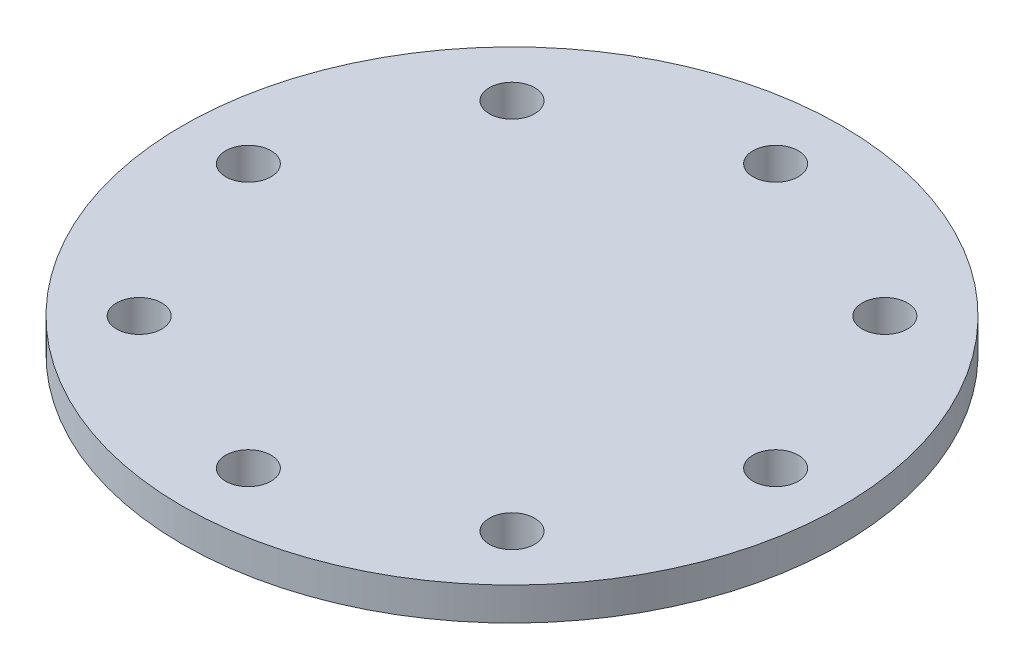
ISO-10303-21;
HEADER;
FILE_DESCRIPTION(('STEP AP214'),'2;1');
FILE_NAME('part.step','',(''),(''),'','','');
FILE_SCHEMA(('AUTOMOTIVE_DESIGN { 1 0 10303 214 1 1 1 1 }'));
ENDSEC;
DATA;
#1=APPLICATION_CONTEXT('core data for automotive mechanical design processes');
#2=APPLICATION_PROTOCOL_DEFINITION('international standard','automotive_design',2000,#1);
#3=PRODUCT_CONTEXT('',#1,'mechanical');
#4=PRODUCT('Part','Part','',(#3));
#5=PRODUCT_RELATED_PRODUCT_CATEGORY('part','',(#4));
#6=PRODUCT_DEFINITION_FORMATION('','',#4);
#7=PRODUCT_DEFINITION_CONTEXT('part definition',#1,'design');
#8=PRODUCT_DEFINITION('design','',#6,#7);
#9=PRODUCT_DEFINITION_SHAPE('','',#8);
#10=(LENGTH_UNIT() NAMED_UNIT(*) SI_UNIT(.MILLI.,.METRE.));
#11=(NAMED_UNIT(*) PLANE_ANGLE_UNIT() SI_UNIT($,.RADIAN.));
#12=(NAMED_UNIT(*) SI_UNIT($,.STERADIAN.) SOLID_ANGLE_UNIT());
#13=UNCERTAINTY_MEASURE_WITH_UNIT(LENGTH_MEASURE(1.E-05),#10,'distance_accuracy_value','');
#14=(GEOMETRIC_REPRESENTATION_CONTEXT(3) GLOBAL_UNCERTAINTY_ASSIGNED_CONTEXT((#13)) GLOBAL_UNIT_ASSIGNED_CONTEXT((#10,
#11,#12)) REPRESENTATION_CONTEXT('',''));
#15=CARTESIAN_POINT('',(0.,0.,0.));
#16=DIRECTION('',(0.,0.,1.));
#17=DIRECTION('',(1.,0.,0.));
#18=AXIS2_PLACEMENT_3D('',#15,#16,#17);
#19=CARTESIAN_POINT('',(0.,12.7,0.));
#20=DIRECTION('',(0.,-1.,0.));
#21=DIRECTION('',(0.,0.,-1.));
#22=AXIS2_PLACEMENT_3D('',#19,#20,#21);
#23=CYLINDRICAL_SURFACE('',#22,127.);
#24=CARTESIAN_POINT('',(0.,12.7,0.));
#25=DIRECTION('',(0.,1.,0.));
#26=DIRECTION('',(0.,0.,1.));
#27=AXIS2_PLACEMENT_3D('',#24,#25,#26);
#28=CIRCLE('',#27,127.);
#29=CARTESIAN_POINT('',(0.,12.7,127.));
#30=VERTEX_POINT('',#29);
#31=EDGE_CURVE('E10',#30,#30,#28,.T.);
#32=ORIENTED_EDGE('',*,*,#31,.F.);
#33=EDGE_LOOP('',(#32));
#34=FACE_BOUND('',#33,.T.);
#35=CARTESIAN_POINT('',(0.,0.,0.));
#36=DIRECTION('',(0.,1.,0.));
#37=DIRECTION('',(0.,0.,1.));
#38=AXIS2_PLACEMENT_3D('',#35,#36,#37);
#39=CIRCLE('',#38,127.);
#40=CARTESIAN_POINT('',(0.,0.,127.));
#41=VERTEX_POINT('',#40);
#42=EDGE_CURVE('E42',#41,#41,#39,.T.);
#43=ORIENTED_EDGE('',*,*,#42,.T.);
#44=EDGE_LOOP('',(#43));
#45=FACE_BOUND('',#44,.T.);
#46=ADVANCED_FACE('F36',(#34,#45),#23,.T.);
#47=CARTESIAN_POINT('',(0.,12.7,0.));
#48=DIRECTION('',(0.,1.,0.));
#49=DIRECTION('',(0.,0.,1.));
#50=AXIS2_PLACEMENT_3D('',#47,#48,#49);
#51=PLANE('',#50);
#52=CARTESIAN_POINT('',(71.8420489685541,12.7,-71.8420489685524));
#53=DIRECTION('',(0.,1.,0.));
#54=DIRECTION('',(0.,0.,1.));
#55=AXIS2_PLACEMENT_3D('',#52,#53,#54);
#56=CIRCLE('',#55,8.73125);
#57=CARTESIAN_POINT('',(71.8420489685541,12.7,-63.1107989685524));
#58=VERTEX_POINT('',#57);
#59=EDGE_CURVE('E94',#58,#58,#56,.T.);
#60=ORIENTED_EDGE('',*,*,#59,.F.);
#61=EDGE_LOOP('',(#60));
#62=FACE_BOUND('',#61,.T.);
#63=CARTESIAN_POINT('',(1.06420412846614E-12,12.7,-101.6));
#64=DIRECTION('',(0.,1.,0.));
#65=DIRECTION('',(0.,0.,1.));
#66=AXIS2_PLACEMENT_3D('',#63,#64,#65);
#67=CIRCLE('',#66,8.73125);
#68=CARTESIAN_POINT('',(1.06420412846614E-12,12.7,-92.86875));
#69=VERTEX_POINT('',#68);
#70=EDGE_CURVE('E88',#69,#69,#67,.T.);
#71=ORIENTED_EDGE('',*,*,#70,.F.);
#72=EDGE_LOOP('',(#71));
#73=FACE_BOUND('',#72,.T.);
#74=CARTESIAN_POINT('',(-71.8420489685526,12.7,-71.8420489685539));
#75=DIRECTION('',(0.,1.,0.));
#76=DIRECTION('',(0.,0.,1.));
#77=AXIS2_PLACEMENT_3D('',#74,#75,#76);
#78=CIRCLE('',#77,8.73125);
#79=CARTESIAN_POINT('',(-71.8420489685526,12.7,-63.1107989685539));
#80=VERTEX_POINT('',#79);
#81=EDGE_CURVE('E82',#80,#80,#78,.T.);
#82=ORIENTED_EDGE('',*,*,#81,.F.);
#83=EDGE_LOOP('',(#82));
#84=FACE_BOUND('',#83,.T.);
#85=CARTESIAN_POINT('',(-101.6,12.7,-7.09469418977426E-13));
#86=DIRECTION('',(0.,1.,0.));
#87=DIRECTION('',(0.,0.,1.));
#88=AXIS2_PLACEMENT_3D('',#85,#86,#87);
#89=CIRCLE('',#88,8.73125);
#90=CARTESIAN_POINT('',(-101.6,12.7,8.73124999999929));
#91=VERTEX_POINT('',#90);
#92=EDGE_CURVE('E76',#91,#91,#89,.T.);
#93=ORIENTED_EDGE('',*,*,#92,.F.);
#94=EDGE_LOOP('',(#93));
#95=FACE_BOUND('',#94,.T.);
#96=CARTESIAN_POINT('',(-71.8420489685536,12.7,71.8420489685528));
#97=DIRECTION('',(0.,1.,0.));
#98=DIRECTION('',(0.,0.,1.));
#99=AXIS2_PLACEMENT_3D('',#96,#97,#98);
#100=CIRCLE('',#99,8.73125);
#101=CARTESIAN_POINT('',(-71.8420489685536,12.7,80.5732989685528));
#102=VERTEX_POINT('',#101);
#103=EDGE_CURVE('E70',#102,#102,#100,.T.);
#104=ORIENTED_EDGE('',*,*,#103,.F.);
#105=EDGE_LOOP('',(#104));
#106=FACE_BOUND('',#105,.T.);
#107=CARTESIAN_POINT('',(-3.54734709488713E-13,12.7,101.6));
#108=DIRECTION('',(0.,1.,0.));
#109=DIRECTION('',(0.,0.,1.));
#110=AXIS2_PLACEMENT_3D('',#107,#108,#109);
#111=CIRCLE('',#110,8.73125);
#112=CARTESIAN_POINT('',(-3.54734709488713E-13,12.7,110.33125));
#113=VERTEX_POINT('',#112);
#114=EDGE_CURVE('E64',#113,#113,#111,.T.);
#115=ORIENTED_EDGE('',*,*,#114,.F.);
#116=EDGE_LOOP('',(#115));
#117=FACE_BOUND('',#116,.T.);
#118=CARTESIAN_POINT('',(71.8420489685531,12.7,71.8420489685534));
#119=DIRECTION('',(0.,1.,0.));
#120=DIRECTION('',(0.,0.,1.));
#121=AXIS2_PLACEMENT_3D('',#118,#119,#120);
#122=CIRCLE('',#121,8.73125);
#123=CARTESIAN_POINT('',(71.8420489685531,12.7,80.5732989685533));
#124=VERTEX_POINT('',#123);
#125=EDGE_CURVE('E58',#124,#124,#122,.T.);
#126=ORIENTED_EDGE('',*,*,#125,.F.);
#127=EDGE_LOOP('',(#126));
#128=FACE_BOUND('',#127,.T.);
#129=CARTESIAN_POINT('',(101.6,12.7,0.));
#130=DIRECTION('',(0.,1.,0.));
#131=DIRECTION('',(0.,0.,1.));
#132=AXIS2_PLACEMENT_3D('',#129,#130,#131);
#133=CIRCLE('',#132,8.73125);
#134=CARTESIAN_POINT('',(101.6,12.7,8.73125));
#135=VERTEX_POINT('',#134);
#136=EDGE_CURVE('E50',#135,#135,#133,.T.);
#137=ORIENTED_EDGE('',*,*,#136,.F.);
#138=EDGE_LOOP('',(#137));
#139=FACE_BOUND('',#138,.T.);
#140=ORIENTED_EDGE('',*,*,#31,.T.);
#141=EDGE_LOOP('',(#140));
#142=FACE_BOUND('',#141,.T.);
#143=ADVANCED_FACE('F100',(#62,#73,#84,#95,#106,#117,#128,#139,#142),#51,.T.);
#144=CARTESIAN_POINT('',(0.,0.,0.));
#145=DIRECTION('',(0.,1.,0.));
#146=DIRECTION('',(0.,0.,1.));
#147=AXIS2_PLACEMENT_3D('',#144,#145,#146);
#148=PLANE('',#147);
#149=CARTESIAN_POINT('',(71.8420489685541,0.,-71.8420489685524));
#150=DIRECTION('',(0.,1.,0.));
#151=DIRECTION('',(0.,0.,1.));
#152=AXIS2_PLACEMENT_3D('',#149,#150,#151);
#153=CIRCLE('',#152,8.73125);
#154=CARTESIAN_POINT('',(71.8420489685541,0.,-63.1107989685524));
#155=VERTEX_POINT('',#154);
#156=EDGE_CURVE('E91',#155,#155,#153,.T.);
#157=ORIENTED_EDGE('',*,*,#156,.T.);
#158=EDGE_LOOP('',(#157));
#159=FACE_BOUND('',#158,.T.);
#160=CARTESIAN_POINT('',(1.06420412846614E-12,0.,-101.6));
#161=DIRECTION('',(0.,1.,0.));
#162=DIRECTION('',(0.,0.,1.));
#163=AXIS2_PLACEMENT_3D('',#160,#161,#162);
#164=CIRCLE('',#163,8.73125);
#165=CARTESIAN_POINT('',(1.06420412846614E-12,0.,-92.86875));
#166=VERTEX_POINT('',#165);
#167=EDGE_CURVE('E85',#166,#166,#164,.T.);
#168=ORIENTED_EDGE('',*,*,#167,.T.);
#169=EDGE_LOOP('',(#168));
#170=FACE_BOUND('',#169,.T.);
#171=CARTESIAN_POINT('',(-71.8420489685526,0.,-71.8420489685539));
#172=DIRECTION('',(0.,1.,0.));
#173=DIRECTION('',(0.,0.,1.));
#174=AXIS2_PLACEMENT_3D('',#171,#172,#173);
#175=CIRCLE('',#174,8.73125);
#176=CARTESIAN_POINT('',(-71.8420489685526,0.,-63.1107989685539));
#177=VERTEX_POINT('',#176);
#178=EDGE_CURVE('E79',#177,#177,#175,.T.);
#179=ORIENTED_EDGE('',*,*,#178,.T.);
#180=EDGE_LOOP('',(#179));
#181=FACE_BOUND('',#180,.T.);
#182=CARTESIAN_POINT('',(-101.6,0.,-7.09469418977426E-13));
#183=DIRECTION('',(0.,1.,0.));
#184=DIRECTION('',(0.,0.,1.));
#185=AXIS2_PLACEMENT_3D('',#182,#183,#184);
#186=CIRCLE('',#185,8.73125);
#187=CARTESIAN_POINT('',(-101.6,0.,8.73124999999929));
#188=VERTEX_POINT('',#187);
#189=EDGE_CURVE('E73',#188,#188,#186,.T.);
#190=ORIENTED_EDGE('',*,*,#189,.T.);
#191=EDGE_LOOP('',(#190));
#192=FACE_BOUND('',#191,.T.);
#193=CARTESIAN_POINT('',(-71.8420489685536,0.,71.8420489685528));
#194=DIRECTION('',(0.,1.,0.));
#195=DIRECTION('',(0.,0.,1.));
#196=AXIS2_PLACEMENT_3D('',#193,#194,#195);
#197=CIRCLE('',#196,8.73125);
#198=CARTESIAN_POINT('',(-71.8420489685536,0.,80.5732989685528));
#199=VERTEX_POINT('',#198);
#200=EDGE_CURVE('E67',#199,#199,#197,.T.);
#201=ORIENTED_EDGE('',*,*,#200,.T.);
#202=EDGE_LOOP('',(#201));
#203=FACE_BOUND('',#202,.T.);
#204=CARTESIAN_POINT('',(-3.54734709488713E-13,0.,101.6));
#205=DIRECTION('',(0.,1.,0.));
#206=DIRECTION('',(0.,0.,1.));
#207=AXIS2_PLACEMENT_3D('',#204,#205,#206);
#208=CIRCLE('',#207,8.73125);
#209=CARTESIAN_POINT('',(-3.54734709488713E-13,0.,110.33125));
#210=VERTEX_POINT('',#209);
#211=EDGE_CURVE('E61',#210,#210,#208,.T.);
#212=ORIENTED_EDGE('',*,*,#211,.T.);
#213=EDGE_LOOP('',(#212));
#214=FACE_BOUND('',#213,.T.);
#215=CARTESIAN_POINT('',(71.8420489685531,0.,71.8420489685534));
#216=DIRECTION('',(0.,1.,0.));
#217=DIRECTION('',(0.,0.,1.));
#218=AXIS2_PLACEMENT_3D('',#215,#216,#217);
#219=CIRCLE('',#218,8.73125);
#220=CARTESIAN_POINT('',(71.8420489685531,0.,80.5732989685533));
#221=VERTEX_POINT('',#220);
#222=EDGE_CURVE('E55',#221,#221,#219,.T.);
#223=ORIENTED_EDGE('',*,*,#222,.T.);
#224=EDGE_LOOP('',(#223));
#225=FACE_BOUND('',#224,.T.);
#226=CARTESIAN_POINT('',(101.6,0.,0.));
#227=DIRECTION('',(0.,1.,0.));
#228=DIRECTION('',(0.,0.,1.));
#229=AXIS2_PLACEMENT_3D('',#226,#227,#228);
#230=CIRCLE('',#229,8.73125);
#231=CARTESIAN_POINT('',(101.6,0.,8.73125));
#232=VERTEX_POINT('',#231);
#233=EDGE_CURVE('E46',#232,#232,#230,.T.);
#234=ORIENTED_EDGE('',*,*,#233,.T.);
#235=EDGE_LOOP('',(#234));
#236=FACE_BOUND('',#235,.T.);
#237=ORIENTED_EDGE('',*,*,#42,.F.);
#238=EDGE_LOOP('',(#237));
#239=FACE_BOUND('',#238,.T.);
#240=ADVANCED_FACE('F103',(#159,#170,#181,#192,#203,#214,#225,#236,#239),#148,.F.);
#241=CARTESIAN_POINT('',(101.6,12.7,0.));
#242=DIRECTION('',(0.,1.,0.));
#243=DIRECTION('',(0.,0.,1.));
#244=AXIS2_PLACEMENT_3D('',#241,#242,#243);
#245=CYLINDRICAL_SURFACE('',#244,8.73125);
#246=ORIENTED_EDGE('',*,*,#233,.F.);
#247=EDGE_LOOP('',(#246));
#248=FACE_BOUND('',#247,.T.);
#249=ORIENTED_EDGE('',*,*,#136,.T.);
#250=EDGE_LOOP('',(#249));
#251=FACE_BOUND('',#250,.T.);
#252=ADVANCED_FACE('F118',(#248,#251),#245,.F.);
#253=CARTESIAN_POINT('',(71.8420489685531,12.7,71.8420489685534));
#254=DIRECTION('',(0.,1.,0.));
#255=DIRECTION('',(0.,0.,1.));
#256=AXIS2_PLACEMENT_3D('',#253,#254,#255);
#257=CYLINDRICAL_SURFACE('',#256,8.73125);
#258=ORIENTED_EDGE('',*,*,#222,.F.);
#259=EDGE_LOOP('',(#258));
#260=FACE_BOUND('',#259,.T.);
#261=ORIENTED_EDGE('',*,*,#125,.T.);
#262=EDGE_LOOP('',(#261));
#263=FACE_BOUND('',#262,.T.);
#264=ADVANCED_FACE('F120',(#260,#263),#257,.F.);
#265=CARTESIAN_POINT('',(-3.54734709488713E-13,12.7,101.6));
#266=DIRECTION('',(0.,1.,0.));
#267=DIRECTION('',(0.,0.,1.));
#268=AXIS2_PLACEMENT_3D('',#265,#266,#267);
#269=CYLINDRICAL_SURFACE('',#268,8.73125);
#270=ORIENTED_EDGE('',*,*,#211,.F.);
#271=EDGE_LOOP('',(#270));
#272=FACE_BOUND('',#271,.T.);
#273=ORIENTED_EDGE('',*,*,#114,.T.);
#274=EDGE_LOOP('',(#273));
#275=FACE_BOUND('',#274,.T.);
#276=ADVANCED_FACE('F127',(#272,#275),#269,.F.);
#277=CARTESIAN_POINT('',(-71.8420489685536,12.7,71.8420489685528));
#278=DIRECTION('',(0.,1.,0.));
#279=DIRECTION('',(0.,0.,1.));
#280=AXIS2_PLACEMENT_3D('',#277,#278,#279);
#281=CYLINDRICAL_SURFACE('',#280,8.73125);
#282=ORIENTED_EDGE('',*,*,#200,.F.);
#283=EDGE_LOOP('',(#282));
#284=FACE_BOUND('',#283,.T.);
#285=ORIENTED_EDGE('',*,*,#103,.T.);
#286=EDGE_LOOP('',(#285));
#287=FACE_BOUND('',#286,.T.);
#288=ADVANCED_FACE('F164',(#284,#287),#281,.F.);
#289=CARTESIAN_POINT('',(-101.6,12.7,-7.09469418977426E-13));
#290=DIRECTION('',(0.,1.,0.));
#291=DIRECTION('',(0.,0.,1.));
#292=AXIS2_PLACEMENT_3D('',#289,#290,#291);
#293=CYLINDRICAL_SURFACE('',#292,8.73125);
#294=ORIENTED_EDGE('',*,*,#189,.F.);
#295=EDGE_LOOP('',(#294));
#296=FACE_BOUND('',#295,.T.);
#297=ORIENTED_EDGE('',*,*,#92,.T.);
#298=EDGE_LOOP('',(#297));
#299=FACE_BOUND('',#298,.T.);
#300=ADVANCED_FACE('F174',(#296,#299),#293,.F.);
#301=CARTESIAN_POINT('',(-71.8420489685526,12.7,-71.8420489685539));
#302=DIRECTION('',(0.,1.,0.));
#303=DIRECTION('',(0.,0.,1.));
#304=AXIS2_PLACEMENT_3D('',#301,#302,#303);
#305=CYLINDRICAL_SURFACE('',#304,8.73125);
#306=ORIENTED_EDGE('',*,*,#178,.F.);
#307=EDGE_LOOP('',(#306));
#308=FACE_BOUND('',#307,.T.);
#309=ORIENTED_EDGE('',*,*,#81,.T.);
#310=EDGE_LOOP('',(#309));
#311=FACE_BOUND('',#310,.T.);
#312=ADVANCED_FACE('F184',(#308,#311),#305,.F.);
#313=CARTESIAN_POINT('',(1.06420412846614E-12,12.7,-101.6));
#314=DIRECTION('',(0.,1.,0.));
#315=DIRECTION('',(0.,0.,1.));
#316=AXIS2_PLACEMENT_3D('',#313,#314,#315);
#317=CYLINDRICAL_SURFACE('',#316,8.73125);
#318=ORIENTED_EDGE('',*,*,#167,.F.);
#319=EDGE_LOOP('',(#318));
#320=FACE_BOUND('',#319,.T.);
#321=ORIENTED_EDGE('',*,*,#70,.T.);
#322=EDGE_LOOP('',(#321));
#323=FACE_BOUND('',#322,.T.);
#324=ADVANCED_FACE('F194',(#320,#323),#317,.F.);
#325=CARTESIAN_POINT('',(71.8420489685541,12.7,-71.8420489685524));
#326=DIRECTION('',(0.,1.,0.));
#327=DIRECTION('',(0.,0.,1.));
#328=AXIS2_PLACEMENT_3D('',#325,#326,#327);
#329=CYLINDRICAL_SURFACE('',#328,8.73125);
#330=ORIENTED_EDGE('',*,*,#156,.F.);
#331=EDGE_LOOP('',(#330));
#332=FACE_BOUND('',#331,.T.);
#333=ORIENTED_EDGE('',*,*,#59,.T.);
#334=EDGE_LOOP('',(#333));
#335=FACE_BOUND('',#334,.T.);
#336=ADVANCED_FACE('F98',(#332,#335),#329,.F.);
#337=CLOSED_SHELL('',(#46,#143,#240,#252,#264,#276,#288,#300,#312,#324,#336));
#338=MANIFOLD_SOLID_BREP('B2',#337);
#339=ADVANCED_BREP_SHAPE_REPRESENTATION('',(#18,#338),#14);
#340=SHAPE_DEFINITION_REPRESENTATION(#9,#339);
ENDSEC;
END-ISO-10303-21;
